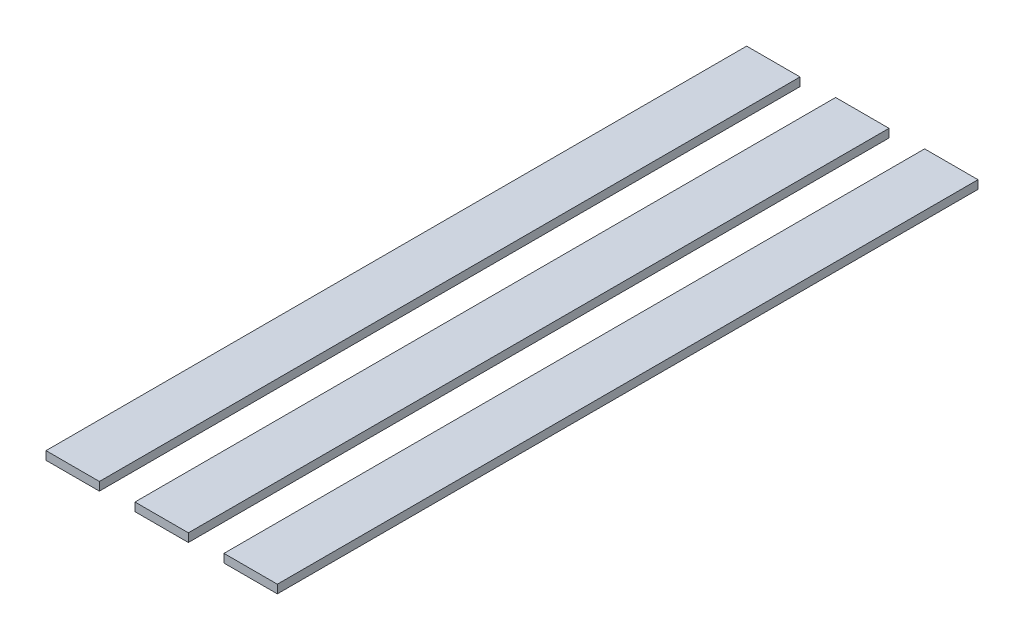
ISO-10303-21;
HEADER;
FILE_DESCRIPTION(('STEP AP214'),'2;1');
FILE_NAME('part.step','',(''),(''),'','','');
FILE_SCHEMA(('AUTOMOTIVE_DESIGN { 1 0 10303 214 1 1 1 1 }'));
ENDSEC;
DATA;
#1=APPLICATION_CONTEXT('core data for automotive mechanical design processes');
#2=APPLICATION_PROTOCOL_DEFINITION('international standard','automotive_design',2000,#1);
#3=PRODUCT_CONTEXT('',#1,'mechanical');
#4=PRODUCT('Part','Part','',(#3));
#5=PRODUCT_RELATED_PRODUCT_CATEGORY('part','',(#4));
#6=PRODUCT_DEFINITION_FORMATION('','',#4);
#7=PRODUCT_DEFINITION_CONTEXT('part definition',#1,'design');
#8=PRODUCT_DEFINITION('design','',#6,#7);
#9=PRODUCT_DEFINITION_SHAPE('','',#8);
#10=(LENGTH_UNIT() NAMED_UNIT(*) SI_UNIT(.MILLI.,.METRE.));
#11=(NAMED_UNIT(*) PLANE_ANGLE_UNIT() SI_UNIT($,.RADIAN.));
#12=(NAMED_UNIT(*) SI_UNIT($,.STERADIAN.) SOLID_ANGLE_UNIT());
#13=UNCERTAINTY_MEASURE_WITH_UNIT(LENGTH_MEASURE(1.E-05),#10,'distance_accuracy_value','');
#14=(GEOMETRIC_REPRESENTATION_CONTEXT(3) GLOBAL_UNCERTAINTY_ASSIGNED_CONTEXT((#13)) GLOBAL_UNIT_ASSIGNED_CONTEXT((#10,
#11,#12)) REPRESENTATION_CONTEXT('',''));
#15=CARTESIAN_POINT('',(0.,0.,0.));
#16=DIRECTION('',(0.,0.,1.));
#17=DIRECTION('',(1.,0.,0.));
#18=AXIS2_PLACEMENT_3D('',#15,#16,#17);
#19=CARTESIAN_POINT('',(44.45,-3.00000000000001,500.));
#20=DIRECTION('',(1.,0.,0.));
#21=DIRECTION('',(0.,0.,-1.));
#22=AXIS2_PLACEMENT_3D('',#19,#20,#21);
#23=PLANE('',#22);
#24=DIRECTION('',(0.,-1.,0.));
#25=VECTOR('',#24,1.);
#26=CARTESIAN_POINT('',(44.45,-3.00000000000001,0.));
#27=LINE('',#26,#25);
#28=CARTESIAN_POINT('',(44.45,3.,0.));
#29=VERTEX_POINT('',#28);
#30=CARTESIAN_POINT('',(44.45,-3.00000000000001,0.));
#31=VERTEX_POINT('',#30);
#32=EDGE_CURVE('E111',#29,#31,#27,.T.);
#33=ORIENTED_EDGE('',*,*,#32,.T.);
#34=DIRECTION('',(0.,0.,-1.));
#35=VECTOR('',#34,1.);
#36=CARTESIAN_POINT('',(44.45,-3.00000000000001,500.));
#37=LINE('',#36,#35);
#38=CARTESIAN_POINT('',(44.45,-3.00000000000001,500.));
#39=VERTEX_POINT('',#38);
#40=EDGE_CURVE('E12',#39,#31,#37,.T.);
#41=ORIENTED_EDGE('',*,*,#40,.F.);
#42=DIRECTION('',(0.,-1.,0.));
#43=VECTOR('',#42,1.);
#44=CARTESIAN_POINT('',(44.45,-3.00000000000001,500.));
#45=LINE('',#44,#43);
#46=CARTESIAN_POINT('',(44.45,3.,500.));
#47=VERTEX_POINT('',#46);
#48=EDGE_CURVE('E99',#47,#39,#45,.T.);
#49=ORIENTED_EDGE('',*,*,#48,.F.);
#50=DIRECTION('',(0.,0.,-1.));
#51=VECTOR('',#50,1.);
#52=CARTESIAN_POINT('',(44.45,3.,500.));
#53=LINE('',#52,#51);
#54=EDGE_CURVE('E107',#47,#29,#53,.T.);
#55=ORIENTED_EDGE('',*,*,#54,.T.);
#56=EDGE_LOOP('',(#33,#41,#49,#55));
#57=FACE_BOUND('',#56,.T.);
#58=ADVANCED_FACE('F48',(#57),#23,.F.);
#59=CARTESIAN_POINT('',(82.55,-3.,500.));
#60=DIRECTION('',(0.,1.,0.));
#61=DIRECTION('',(-1.,0.,0.));
#62=AXIS2_PLACEMENT_3D('',#59,#60,#61);
#63=PLANE('',#62);
#64=DIRECTION('',(1.,0.,0.));
#65=VECTOR('',#64,1.);
#66=CARTESIAN_POINT('',(82.55,-3.,0.));
#67=LINE('',#66,#65);
#68=CARTESIAN_POINT('',(82.55,-3.,0.));
#69=VERTEX_POINT('',#68);
#70=EDGE_CURVE('E103',#31,#69,#67,.T.);
#71=ORIENTED_EDGE('',*,*,#70,.T.);
#72=DIRECTION('',(0.,0.,-1.));
#73=VECTOR('',#72,1.);
#74=CARTESIAN_POINT('',(82.55,-3.,500.));
#75=LINE('',#74,#73);
#76=CARTESIAN_POINT('',(82.55,-3.,500.));
#77=VERTEX_POINT('',#76);
#78=EDGE_CURVE('E56',#77,#69,#75,.T.);
#79=ORIENTED_EDGE('',*,*,#78,.F.);
#80=DIRECTION('',(1.,0.,0.));
#81=VECTOR('',#80,1.);
#82=CARTESIAN_POINT('',(82.55,-3.,500.));
#83=LINE('',#82,#81);
#84=EDGE_CURVE('E94',#39,#77,#83,.T.);
#85=ORIENTED_EDGE('',*,*,#84,.F.);
#86=ORIENTED_EDGE('',*,*,#40,.T.);
#87=EDGE_LOOP('',(#71,#79,#85,#86));
#88=FACE_BOUND('',#87,.T.);
#89=ADVANCED_FACE('F102',(#88),#63,.F.);
#90=CARTESIAN_POINT('',(82.55,-3.,500.));
#91=DIRECTION('',(-1.,0.,0.));
#92=DIRECTION('',(0.,0.,1.));
#93=AXIS2_PLACEMENT_3D('',#90,#91,#92);
#94=PLANE('',#93);
#95=DIRECTION('',(0.,1.,0.));
#96=VECTOR('',#95,1.);
#97=CARTESIAN_POINT('',(82.55,-3.,0.));
#98=LINE('',#97,#96);
#99=CARTESIAN_POINT('',(82.55,3.,0.));
#100=VERTEX_POINT('',#99);
#101=EDGE_CURVE('E81',#69,#100,#98,.T.);
#102=ORIENTED_EDGE('',*,*,#101,.T.);
#103=DIRECTION('',(0.,0.,-1.));
#104=VECTOR('',#103,1.);
#105=CARTESIAN_POINT('',(82.55,3.,500.));
#106=LINE('',#105,#104);
#107=CARTESIAN_POINT('',(82.55,3.,500.));
#108=VERTEX_POINT('',#107);
#109=EDGE_CURVE('E104',#108,#100,#106,.T.);
#110=ORIENTED_EDGE('',*,*,#109,.F.);
#111=DIRECTION('',(0.,1.,0.));
#112=VECTOR('',#111,1.);
#113=CARTESIAN_POINT('',(82.55,-3.,500.));
#114=LINE('',#113,#112);
#115=EDGE_CURVE('E97',#77,#108,#114,.T.);
#116=ORIENTED_EDGE('',*,*,#115,.F.);
#117=ORIENTED_EDGE('',*,*,#78,.T.);
#118=EDGE_LOOP('',(#102,#110,#116,#117));
#119=FACE_BOUND('',#118,.T.);
#120=ADVANCED_FACE('F105',(#119),#94,.F.);
#121=CARTESIAN_POINT('',(82.55,3.,500.));
#122=DIRECTION('',(0.,-1.,0.));
#123=DIRECTION('',(1.,0.,0.));
#124=AXIS2_PLACEMENT_3D('',#121,#122,#123);
#125=PLANE('',#124);
#126=DIRECTION('',(-1.,0.,0.));
#127=VECTOR('',#126,1.);
#128=CARTESIAN_POINT('',(82.55,3.,0.));
#129=LINE('',#128,#127);
#130=EDGE_CURVE('E87',#100,#29,#129,.T.);
#131=ORIENTED_EDGE('',*,*,#130,.T.);
#132=ORIENTED_EDGE('',*,*,#54,.F.);
#133=DIRECTION('',(-1.,0.,0.));
#134=VECTOR('',#133,1.);
#135=CARTESIAN_POINT('',(82.55,3.,500.));
#136=LINE('',#135,#134);
#137=EDGE_CURVE('E64',#108,#47,#136,.T.);
#138=ORIENTED_EDGE('',*,*,#137,.F.);
#139=ORIENTED_EDGE('',*,*,#109,.T.);
#140=EDGE_LOOP('',(#131,#132,#138,#139));
#141=FACE_BOUND('',#140,.T.);
#142=ADVANCED_FACE('F118',(#141),#125,.F.);
#143=CARTESIAN_POINT('',(0.,0.,500.));
#144=DIRECTION('',(0.,0.,1.));
#145=DIRECTION('',(1.,0.,0.));
#146=AXIS2_PLACEMENT_3D('',#143,#144,#145);
#147=PLANE('',#146);
#148=ORIENTED_EDGE('',*,*,#48,.T.);
#149=ORIENTED_EDGE('',*,*,#84,.T.);
#150=ORIENTED_EDGE('',*,*,#115,.T.);
#151=ORIENTED_EDGE('',*,*,#137,.T.);
#152=EDGE_LOOP('',(#148,#149,#150,#151));
#153=FACE_BOUND('',#152,.T.);
#154=ADVANCED_FACE('F95',(#153),#147,.T.);
#155=CARTESIAN_POINT('',(0.,0.,0.));
#156=DIRECTION('',(0.,0.,1.));
#157=DIRECTION('',(1.,0.,0.));
#158=AXIS2_PLACEMENT_3D('',#155,#156,#157);
#159=PLANE('',#158);
#160=ORIENTED_EDGE('',*,*,#32,.F.);
#161=ORIENTED_EDGE('',*,*,#130,.F.);
#162=ORIENTED_EDGE('',*,*,#101,.F.);
#163=ORIENTED_EDGE('',*,*,#70,.F.);
#164=EDGE_LOOP('',(#160,#161,#162,#163));
#165=FACE_BOUND('',#164,.T.);
#166=ADVANCED_FACE('F121',(#165),#159,.F.);
#167=CLOSED_SHELL('',(#58,#89,#120,#142,#154,#166));
#168=MANIFOLD_SOLID_BREP('B2',#167);
#169=CARTESIAN_POINT('',(-44.45,-3.,500.));
#170=DIRECTION('',(-1.,0.,0.));
#171=DIRECTION('',(0.,0.,1.));
#172=AXIS2_PLACEMENT_3D('',#169,#170,#171);
#173=PLANE('',#172);
#174=DIRECTION('',(0.,1.,0.));
#175=VECTOR('',#174,1.);
#176=CARTESIAN_POINT('',(-44.45,-3.,0.));
#177=LINE('',#176,#175);
#178=CARTESIAN_POINT('',(-44.45,-3.,0.));
#179=VERTEX_POINT('',#178);
#180=CARTESIAN_POINT('',(-44.45,3.,0.));
#181=VERTEX_POINT('',#180);
#182=EDGE_CURVE('E248',#179,#181,#177,.T.);
#183=ORIENTED_EDGE('',*,*,#182,.T.);
#184=DIRECTION('',(0.,0.,-1.));
#185=VECTOR('',#184,1.);
#186=CARTESIAN_POINT('',(-44.45,3.,500.));
#187=LINE('',#186,#185);
#188=CARTESIAN_POINT('',(-44.45,3.,500.));
#189=VERTEX_POINT('',#188);
#190=EDGE_CURVE('E46',#189,#181,#187,.T.);
#191=ORIENTED_EDGE('',*,*,#190,.F.);
#192=DIRECTION('',(0.,1.,0.));
#193=VECTOR('',#192,1.);
#194=CARTESIAN_POINT('',(-44.45,-3.,500.));
#195=LINE('',#194,#193);
#196=CARTESIAN_POINT('',(-44.45,-3.,500.));
#197=VERTEX_POINT('',#196);
#198=EDGE_CURVE('E236',#197,#189,#195,.T.);
#199=ORIENTED_EDGE('',*,*,#198,.F.);
#200=DIRECTION('',(0.,0.,-1.));
#201=VECTOR('',#200,1.);
#202=CARTESIAN_POINT('',(-44.45,-3.,500.));
#203=LINE('',#202,#201);
#204=EDGE_CURVE('E244',#197,#179,#203,.T.);
#205=ORIENTED_EDGE('',*,*,#204,.T.);
#206=EDGE_LOOP('',(#183,#191,#199,#205));
#207=FACE_BOUND('',#206,.T.);
#208=ADVANCED_FACE('F185',(#207),#173,.F.);
#209=CARTESIAN_POINT('',(-82.55,3.,500.));
#210=DIRECTION('',(0.,-1.,0.));
#211=DIRECTION('',(0.,0.,-1.));
#212=AXIS2_PLACEMENT_3D('',#209,#210,#211);
#213=PLANE('',#212);
#214=DIRECTION('',(-1.,0.,0.));
#215=VECTOR('',#214,1.);
#216=CARTESIAN_POINT('',(-82.55,3.,0.));
#217=LINE('',#216,#215);
#218=CARTESIAN_POINT('',(-82.55,3.,0.));
#219=VERTEX_POINT('',#218);
#220=EDGE_CURVE('E240',#181,#219,#217,.T.);
#221=ORIENTED_EDGE('',*,*,#220,.T.);
#222=DIRECTION('',(0.,0.,-1.));
#223=VECTOR('',#222,1.);
#224=CARTESIAN_POINT('',(-82.55,3.,500.));
#225=LINE('',#224,#223);
#226=CARTESIAN_POINT('',(-82.55,3.,500.));
#227=VERTEX_POINT('',#226);
#228=EDGE_CURVE('E193',#227,#219,#225,.T.);
#229=ORIENTED_EDGE('',*,*,#228,.F.);
#230=DIRECTION('',(-1.,0.,0.));
#231=VECTOR('',#230,1.);
#232=CARTESIAN_POINT('',(-82.55,3.,500.));
#233=LINE('',#232,#231);
#234=EDGE_CURVE('E231',#189,#227,#233,.T.);
#235=ORIENTED_EDGE('',*,*,#234,.F.);
#236=ORIENTED_EDGE('',*,*,#190,.T.);
#237=EDGE_LOOP('',(#221,#229,#235,#236));
#238=FACE_BOUND('',#237,.T.);
#239=ADVANCED_FACE('F239',(#238),#213,.F.);
#240=CARTESIAN_POINT('',(-82.55,-3.,500.));
#241=DIRECTION('',(1.,0.,0.));
#242=DIRECTION('',(0.,0.,-1.));
#243=AXIS2_PLACEMENT_3D('',#240,#241,#242);
#244=PLANE('',#243);
#245=DIRECTION('',(0.,-1.,0.));
#246=VECTOR('',#245,1.);
#247=CARTESIAN_POINT('',(-82.55,-3.,0.));
#248=LINE('',#247,#246);
#249=CARTESIAN_POINT('',(-82.55,-3.,0.));
#250=VERTEX_POINT('',#249);
#251=EDGE_CURVE('E218',#219,#250,#248,.T.);
#252=ORIENTED_EDGE('',*,*,#251,.T.);
#253=DIRECTION('',(0.,0.,-1.));
#254=VECTOR('',#253,1.);
#255=CARTESIAN_POINT('',(-82.55,-3.,500.));
#256=LINE('',#255,#254);
#257=CARTESIAN_POINT('',(-82.55,-3.,500.));
#258=VERTEX_POINT('',#257);
#259=EDGE_CURVE('E241',#258,#250,#256,.T.);
#260=ORIENTED_EDGE('',*,*,#259,.F.);
#261=DIRECTION('',(0.,-1.,0.));
#262=VECTOR('',#261,1.);
#263=CARTESIAN_POINT('',(-82.55,-3.,500.));
#264=LINE('',#263,#262);
#265=EDGE_CURVE('E234',#227,#258,#264,.T.);
#266=ORIENTED_EDGE('',*,*,#265,.F.);
#267=ORIENTED_EDGE('',*,*,#228,.T.);
#268=EDGE_LOOP('',(#252,#260,#266,#267));
#269=FACE_BOUND('',#268,.T.);
#270=ADVANCED_FACE('F242',(#269),#244,.F.);
#271=CARTESIAN_POINT('',(-82.55,-3.,500.));
#272=DIRECTION('',(0.,1.,0.));
#273=DIRECTION('',(0.,0.,1.));
#274=AXIS2_PLACEMENT_3D('',#271,#272,#273);
#275=PLANE('',#274);
#276=DIRECTION('',(1.,0.,0.));
#277=VECTOR('',#276,1.);
#278=CARTESIAN_POINT('',(-82.55,-3.,0.));
#279=LINE('',#278,#277);
#280=EDGE_CURVE('E224',#250,#179,#279,.T.);
#281=ORIENTED_EDGE('',*,*,#280,.T.);
#282=ORIENTED_EDGE('',*,*,#204,.F.);
#283=DIRECTION('',(1.,0.,0.));
#284=VECTOR('',#283,1.);
#285=CARTESIAN_POINT('',(-82.55,-3.,500.));
#286=LINE('',#285,#284);
#287=EDGE_CURVE('E201',#258,#197,#286,.T.);
#288=ORIENTED_EDGE('',*,*,#287,.F.);
#289=ORIENTED_EDGE('',*,*,#259,.T.);
#290=EDGE_LOOP('',(#281,#282,#288,#289));
#291=FACE_BOUND('',#290,.T.);
#292=ADVANCED_FACE('F255',(#291),#275,.F.);
#293=CARTESIAN_POINT('',(0.,0.,500.));
#294=DIRECTION('',(0.,0.,-1.));
#295=DIRECTION('',(-1.,0.,0.));
#296=AXIS2_PLACEMENT_3D('',#293,#294,#295);
#297=PLANE('',#296);
#298=ORIENTED_EDGE('',*,*,#198,.T.);
#299=ORIENTED_EDGE('',*,*,#234,.T.);
#300=ORIENTED_EDGE('',*,*,#265,.T.);
#301=ORIENTED_EDGE('',*,*,#287,.T.);
#302=EDGE_LOOP('',(#298,#299,#300,#301));
#303=FACE_BOUND('',#302,.T.);
#304=ADVANCED_FACE('F232',(#303),#297,.F.);
#305=CARTESIAN_POINT('',(0.,0.,0.));
#306=DIRECTION('',(0.,0.,-1.));
#307=DIRECTION('',(-1.,0.,0.));
#308=AXIS2_PLACEMENT_3D('',#305,#306,#307);
#309=PLANE('',#308);
#310=ORIENTED_EDGE('',*,*,#182,.F.);
#311=ORIENTED_EDGE('',*,*,#280,.F.);
#312=ORIENTED_EDGE('',*,*,#251,.F.);
#313=ORIENTED_EDGE('',*,*,#220,.F.);
#314=EDGE_LOOP('',(#310,#311,#312,#313));
#315=FACE_BOUND('',#314,.T.);
#316=ADVANCED_FACE('F258',(#315),#309,.T.);
#317=CLOSED_SHELL('',(#208,#239,#270,#292,#304,#316));
#318=MANIFOLD_SOLID_BREP('B6',#317);
#319=CARTESIAN_POINT('',(19.05,-3.,500.));
#320=DIRECTION('',(-1.,0.,0.));
#321=DIRECTION('',(0.,0.,1.));
#322=AXIS2_PLACEMENT_3D('',#319,#320,#321);
#323=PLANE('',#322);
#324=DIRECTION('',(0.,1.,0.));
#325=VECTOR('',#324,1.);
#326=CARTESIAN_POINT('',(19.05,-3.,0.));
#327=LINE('',#326,#325);
#328=CARTESIAN_POINT('',(19.05,-3.,0.));
#329=VERTEX_POINT('',#328);
#330=CARTESIAN_POINT('',(19.05,3.,0.));
#331=VERTEX_POINT('',#330);
#332=EDGE_CURVE('E376',#329,#331,#327,.T.);
#333=ORIENTED_EDGE('',*,*,#332,.T.);
#334=DIRECTION('',(0.,0.,-1.));
#335=VECTOR('',#334,1.);
#336=CARTESIAN_POINT('',(19.05,3.,500.));
#337=LINE('',#336,#335);
#338=CARTESIAN_POINT('',(19.05,3.,500.));
#339=VERTEX_POINT('',#338);
#340=EDGE_CURVE('E183',#339,#331,#337,.T.);
#341=ORIENTED_EDGE('',*,*,#340,.F.);
#342=DIRECTION('',(0.,1.,0.));
#343=VECTOR('',#342,1.);
#344=CARTESIAN_POINT('',(19.05,-3.,500.));
#345=LINE('',#344,#343);
#346=CARTESIAN_POINT('',(19.05,-3.,500.));
#347=VERTEX_POINT('',#346);
#348=EDGE_CURVE('E364',#347,#339,#345,.T.);
#349=ORIENTED_EDGE('',*,*,#348,.F.);
#350=DIRECTION('',(0.,0.,-1.));
#351=VECTOR('',#350,1.);
#352=CARTESIAN_POINT('',(19.05,-3.,500.));
#353=LINE('',#352,#351);
#354=EDGE_CURVE('E372',#347,#329,#353,.T.);
#355=ORIENTED_EDGE('',*,*,#354,.T.);
#356=EDGE_LOOP('',(#333,#341,#349,#355));
#357=FACE_BOUND('',#356,.T.);
#358=ADVANCED_FACE('F313',(#357),#323,.F.);
#359=CARTESIAN_POINT('',(-19.05,3.,500.));
#360=DIRECTION('',(0.,-1.,0.));
#361=DIRECTION('',(0.,0.,-1.));
#362=AXIS2_PLACEMENT_3D('',#359,#360,#361);
#363=PLANE('',#362);
#364=DIRECTION('',(-1.,0.,0.));
#365=VECTOR('',#364,1.);
#366=CARTESIAN_POINT('',(-19.05,3.,0.));
#367=LINE('',#366,#365);
#368=CARTESIAN_POINT('',(-19.05,3.,0.));
#369=VERTEX_POINT('',#368);
#370=EDGE_CURVE('E368',#331,#369,#367,.T.);
#371=ORIENTED_EDGE('',*,*,#370,.T.);
#372=DIRECTION('',(0.,0.,-1.));
#373=VECTOR('',#372,1.);
#374=CARTESIAN_POINT('',(-19.05,3.,500.));
#375=LINE('',#374,#373);
#376=CARTESIAN_POINT('',(-19.05,3.,500.));
#377=VERTEX_POINT('',#376);
#378=EDGE_CURVE('E321',#377,#369,#375,.T.);
#379=ORIENTED_EDGE('',*,*,#378,.F.);
#380=DIRECTION('',(-1.,0.,0.));
#381=VECTOR('',#380,1.);
#382=CARTESIAN_POINT('',(-19.05,3.,500.));
#383=LINE('',#382,#381);
#384=EDGE_CURVE('E359',#339,#377,#383,.T.);
#385=ORIENTED_EDGE('',*,*,#384,.F.);
#386=ORIENTED_EDGE('',*,*,#340,.T.);
#387=EDGE_LOOP('',(#371,#379,#385,#386));
#388=FACE_BOUND('',#387,.T.);
#389=ADVANCED_FACE('F367',(#388),#363,.F.);
#390=CARTESIAN_POINT('',(-19.05,-3.,500.));
#391=DIRECTION('',(1.,0.,0.));
#392=DIRECTION('',(0.,0.,-1.));
#393=AXIS2_PLACEMENT_3D('',#390,#391,#392);
#394=PLANE('',#393);
#395=DIRECTION('',(0.,-1.,0.));
#396=VECTOR('',#395,1.);
#397=CARTESIAN_POINT('',(-19.05,-3.,0.));
#398=LINE('',#397,#396);
#399=CARTESIAN_POINT('',(-19.05,-3.,0.));
#400=VERTEX_POINT('',#399);
#401=EDGE_CURVE('E346',#369,#400,#398,.T.);
#402=ORIENTED_EDGE('',*,*,#401,.T.);
#403=DIRECTION('',(0.,0.,-1.));
#404=VECTOR('',#403,1.);
#405=CARTESIAN_POINT('',(-19.05,-3.,500.));
#406=LINE('',#405,#404);
#407=CARTESIAN_POINT('',(-19.05,-3.,500.));
#408=VERTEX_POINT('',#407);
#409=EDGE_CURVE('E369',#408,#400,#406,.T.);
#410=ORIENTED_EDGE('',*,*,#409,.F.);
#411=DIRECTION('',(0.,-1.,0.));
#412=VECTOR('',#411,1.);
#413=CARTESIAN_POINT('',(-19.05,-3.,500.));
#414=LINE('',#413,#412);
#415=EDGE_CURVE('E362',#377,#408,#414,.T.);
#416=ORIENTED_EDGE('',*,*,#415,.F.);
#417=ORIENTED_EDGE('',*,*,#378,.T.);
#418=EDGE_LOOP('',(#402,#410,#416,#417));
#419=FACE_BOUND('',#418,.T.);
#420=ADVANCED_FACE('F370',(#419),#394,.F.);
#421=CARTESIAN_POINT('',(-19.05,-3.,500.));
#422=DIRECTION('',(0.,1.,0.));
#423=DIRECTION('',(0.,0.,1.));
#424=AXIS2_PLACEMENT_3D('',#421,#422,#423);
#425=PLANE('',#424);
#426=DIRECTION('',(1.,0.,0.));
#427=VECTOR('',#426,1.);
#428=CARTESIAN_POINT('',(-19.05,-3.,0.));
#429=LINE('',#428,#427);
#430=EDGE_CURVE('E352',#400,#329,#429,.T.);
#431=ORIENTED_EDGE('',*,*,#430,.T.);
#432=ORIENTED_EDGE('',*,*,#354,.F.);
#433=DIRECTION('',(1.,0.,0.));
#434=VECTOR('',#433,1.);
#435=CARTESIAN_POINT('',(-19.05,-3.,500.));
#436=LINE('',#435,#434);
#437=EDGE_CURVE('E329',#408,#347,#436,.T.);
#438=ORIENTED_EDGE('',*,*,#437,.F.);
#439=ORIENTED_EDGE('',*,*,#409,.T.);
#440=EDGE_LOOP('',(#431,#432,#438,#439));
#441=FACE_BOUND('',#440,.T.);
#442=ADVANCED_FACE('F383',(#441),#425,.F.);
#443=CARTESIAN_POINT('',(0.,0.,500.));
#444=DIRECTION('',(0.,0.,-1.));
#445=DIRECTION('',(-1.,0.,0.));
#446=AXIS2_PLACEMENT_3D('',#443,#444,#445);
#447=PLANE('',#446);
#448=ORIENTED_EDGE('',*,*,#348,.T.);
#449=ORIENTED_EDGE('',*,*,#384,.T.);
#450=ORIENTED_EDGE('',*,*,#415,.T.);
#451=ORIENTED_EDGE('',*,*,#437,.T.);
#452=EDGE_LOOP('',(#448,#449,#450,#451));
#453=FACE_BOUND('',#452,.T.);
#454=ADVANCED_FACE('F360',(#453),#447,.F.);
#455=CARTESIAN_POINT('',(0.,0.,0.));
#456=DIRECTION('',(0.,0.,-1.));
#457=DIRECTION('',(-1.,0.,0.));
#458=AXIS2_PLACEMENT_3D('',#455,#456,#457);
#459=PLANE('',#458);
#460=ORIENTED_EDGE('',*,*,#332,.F.);
#461=ORIENTED_EDGE('',*,*,#430,.F.);
#462=ORIENTED_EDGE('',*,*,#401,.F.);
#463=ORIENTED_EDGE('',*,*,#370,.F.);
#464=EDGE_LOOP('',(#460,#461,#462,#463));
#465=FACE_BOUND('',#464,.T.);
#466=ADVANCED_FACE('F386',(#465),#459,.T.);
#467=CLOSED_SHELL('',(#358,#389,#420,#442,#454,#466));
#468=MANIFOLD_SOLID_BREP('B40',#467);
#469=ADVANCED_BREP_SHAPE_REPRESENTATION('',(#18,#168,#318,#468),#14);
#470=SHAPE_DEFINITION_REPRESENTATION(#9,#469);
ENDSEC;
END-ISO-10303-21;
